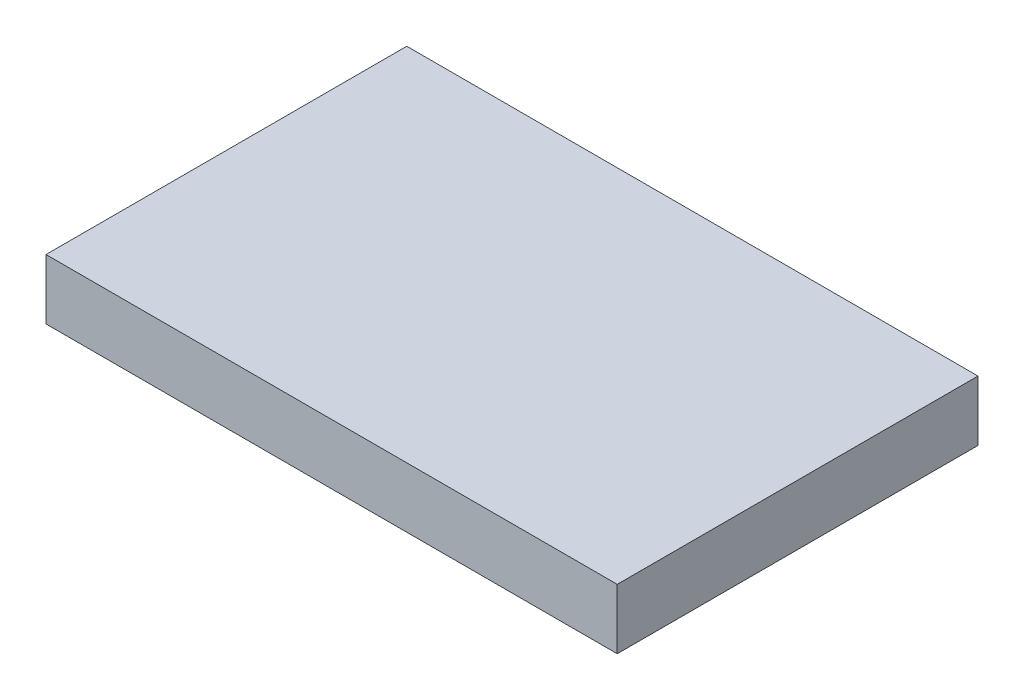
ISO-10303-21;
HEADER;
FILE_DESCRIPTION(('STEP AP214'),'2;1');
FILE_NAME('part.step','',(''),(''),'','','');
FILE_SCHEMA(('AUTOMOTIVE_DESIGN { 1 0 10303 214 1 1 1 1 }'));
ENDSEC;
DATA;
#1=APPLICATION_CONTEXT('core data for automotive mechanical design processes');
#2=APPLICATION_PROTOCOL_DEFINITION('international standard','automotive_design',2000,#1);
#3=PRODUCT_CONTEXT('',#1,'mechanical');
#4=PRODUCT('Part','Part','',(#3));
#5=PRODUCT_RELATED_PRODUCT_CATEGORY('part','',(#4));
#6=PRODUCT_DEFINITION_FORMATION('','',#4);
#7=PRODUCT_DEFINITION_CONTEXT('part definition',#1,'design');
#8=PRODUCT_DEFINITION('design','',#6,#7);
#9=PRODUCT_DEFINITION_SHAPE('','',#8);
#10=(LENGTH_UNIT() NAMED_UNIT(*) SI_UNIT(.MILLI.,.METRE.));
#11=(NAMED_UNIT(*) PLANE_ANGLE_UNIT() SI_UNIT($,.RADIAN.));
#12=(NAMED_UNIT(*) SI_UNIT($,.STERADIAN.) SOLID_ANGLE_UNIT());
#13=UNCERTAINTY_MEASURE_WITH_UNIT(LENGTH_MEASURE(1.E-05),#10,'distance_accuracy_value','');
#14=(GEOMETRIC_REPRESENTATION_CONTEXT(3) GLOBAL_UNCERTAINTY_ASSIGNED_CONTEXT((#13)) GLOBAL_UNIT_ASSIGNED_CONTEXT((#10,
#11,#12)) REPRESENTATION_CONTEXT('',''));
#15=CARTESIAN_POINT('',(0.,0.,0.));
#16=DIRECTION('',(0.,0.,1.));
#17=DIRECTION('',(1.,0.,0.));
#18=AXIS2_PLACEMENT_3D('',#15,#16,#17);
#19=CARTESIAN_POINT('',(0.,4.,0.));
#20=DIRECTION('',(1.,0.,0.));
#21=DIRECTION('',(0.,0.,-1.));
#22=AXIS2_PLACEMENT_3D('',#19,#20,#21);
#23=PLANE('',#22);
#24=DIRECTION('',(0.,0.,1.));
#25=VECTOR('',#24,1.);
#26=CARTESIAN_POINT('',(0.,0.,0.));
#27=LINE('',#26,#25);
#28=CARTESIAN_POINT('',(0.,0.,0.));
#29=VERTEX_POINT('',#28);
#30=CARTESIAN_POINT('',(0.,0.,24.));
#31=VERTEX_POINT('',#30);
#32=EDGE_CURVE('E96',#29,#31,#27,.T.);
#33=ORIENTED_EDGE('',*,*,#32,.T.);
#34=DIRECTION('',(0.,-1.,0.));
#35=VECTOR('',#34,1.);
#36=CARTESIAN_POINT('',(0.,4.,24.));
#37=LINE('',#36,#35);
#38=CARTESIAN_POINT('',(0.,4.,24.));
#39=VERTEX_POINT('',#38);
#40=EDGE_CURVE('E11',#39,#31,#37,.T.);
#41=ORIENTED_EDGE('',*,*,#40,.F.);
#42=DIRECTION('',(0.,0.,1.));
#43=VECTOR('',#42,1.);
#44=CARTESIAN_POINT('',(0.,4.,0.));
#45=LINE('',#44,#43);
#46=CARTESIAN_POINT('',(0.,4.,0.));
#47=VERTEX_POINT('',#46);
#48=EDGE_CURVE('E84',#47,#39,#45,.T.);
#49=ORIENTED_EDGE('',*,*,#48,.F.);
#50=DIRECTION('',(0.,-1.,0.));
#51=VECTOR('',#50,1.);
#52=CARTESIAN_POINT('',(0.,4.,0.));
#53=LINE('',#52,#51);
#54=EDGE_CURVE('E92',#47,#29,#53,.T.);
#55=ORIENTED_EDGE('',*,*,#54,.T.);
#56=EDGE_LOOP('',(#33,#41,#49,#55));
#57=FACE_BOUND('',#56,.T.);
#58=ADVANCED_FACE('F33',(#57),#23,.F.);
#59=CARTESIAN_POINT('',(0.,4.,24.));
#60=DIRECTION('',(0.,0.,-1.));
#61=DIRECTION('',(-1.,0.,0.));
#62=AXIS2_PLACEMENT_3D('',#59,#60,#61);
#63=PLANE('',#62);
#64=DIRECTION('',(1.,0.,0.));
#65=VECTOR('',#64,1.);
#66=CARTESIAN_POINT('',(0.,0.,24.));
#67=LINE('',#66,#65);
#68=CARTESIAN_POINT('',(38.,0.,24.));
#69=VERTEX_POINT('',#68);
#70=EDGE_CURVE('E88',#31,#69,#67,.T.);
#71=ORIENTED_EDGE('',*,*,#70,.T.);
#72=DIRECTION('',(0.,-1.,0.));
#73=VECTOR('',#72,1.);
#74=CARTESIAN_POINT('',(38.,4.,24.));
#75=LINE('',#74,#73);
#76=CARTESIAN_POINT('',(38.,4.,24.));
#77=VERTEX_POINT('',#76);
#78=EDGE_CURVE('E41',#77,#69,#75,.T.);
#79=ORIENTED_EDGE('',*,*,#78,.F.);
#80=DIRECTION('',(1.,0.,0.));
#81=VECTOR('',#80,1.);
#82=CARTESIAN_POINT('',(0.,4.,24.));
#83=LINE('',#82,#81);
#84=EDGE_CURVE('E79',#39,#77,#83,.T.);
#85=ORIENTED_EDGE('',*,*,#84,.F.);
#86=ORIENTED_EDGE('',*,*,#40,.T.);
#87=EDGE_LOOP('',(#71,#79,#85,#86));
#88=FACE_BOUND('',#87,.T.);
#89=ADVANCED_FACE('F87',(#88),#63,.F.);
#90=CARTESIAN_POINT('',(38.,4.,0.));
#91=DIRECTION('',(-1.,0.,0.));
#92=DIRECTION('',(0.,0.,1.));
#93=AXIS2_PLACEMENT_3D('',#90,#91,#92);
#94=PLANE('',#93);
#95=DIRECTION('',(0.,0.,-1.));
#96=VECTOR('',#95,1.);
#97=CARTESIAN_POINT('',(38.,0.,0.));
#98=LINE('',#97,#96);
#99=CARTESIAN_POINT('',(38.,0.,0.));
#100=VERTEX_POINT('',#99);
#101=EDGE_CURVE('E66',#69,#100,#98,.T.);
#102=ORIENTED_EDGE('',*,*,#101,.T.);
#103=DIRECTION('',(0.,-1.,0.));
#104=VECTOR('',#103,1.);
#105=CARTESIAN_POINT('',(38.,4.,0.));
#106=LINE('',#105,#104);
#107=CARTESIAN_POINT('',(38.,4.,0.));
#108=VERTEX_POINT('',#107);
#109=EDGE_CURVE('E89',#108,#100,#106,.T.);
#110=ORIENTED_EDGE('',*,*,#109,.F.);
#111=DIRECTION('',(0.,0.,-1.));
#112=VECTOR('',#111,1.);
#113=CARTESIAN_POINT('',(38.,4.,0.));
#114=LINE('',#113,#112);
#115=EDGE_CURVE('E82',#77,#108,#114,.T.);
#116=ORIENTED_EDGE('',*,*,#115,.F.);
#117=ORIENTED_EDGE('',*,*,#78,.T.);
#118=EDGE_LOOP('',(#102,#110,#116,#117));
#119=FACE_BOUND('',#118,.T.);
#120=ADVANCED_FACE('F90',(#119),#94,.F.);
#121=CARTESIAN_POINT('',(0.,4.,0.));
#122=DIRECTION('',(0.,0.,1.));
#123=DIRECTION('',(1.,0.,0.));
#124=AXIS2_PLACEMENT_3D('',#121,#122,#123);
#125=PLANE('',#124);
#126=DIRECTION('',(-1.,0.,0.));
#127=VECTOR('',#126,1.);
#128=CARTESIAN_POINT('',(0.,0.,0.));
#129=LINE('',#128,#127);
#130=EDGE_CURVE('E72',#100,#29,#129,.T.);
#131=ORIENTED_EDGE('',*,*,#130,.T.);
#132=ORIENTED_EDGE('',*,*,#54,.F.);
#133=DIRECTION('',(-1.,0.,0.));
#134=VECTOR('',#133,1.);
#135=CARTESIAN_POINT('',(0.,4.,0.));
#136=LINE('',#135,#134);
#137=EDGE_CURVE('E49',#108,#47,#136,.T.);
#138=ORIENTED_EDGE('',*,*,#137,.F.);
#139=ORIENTED_EDGE('',*,*,#109,.T.);
#140=EDGE_LOOP('',(#131,#132,#138,#139));
#141=FACE_BOUND('',#140,.T.);
#142=ADVANCED_FACE('F103',(#141),#125,.F.);
#143=CARTESIAN_POINT('',(0.,4.,0.));
#144=DIRECTION('',(0.,1.,0.));
#145=DIRECTION('',(0.,0.,1.));
#146=AXIS2_PLACEMENT_3D('',#143,#144,#145);
#147=PLANE('',#146);
#148=ORIENTED_EDGE('',*,*,#48,.T.);
#149=ORIENTED_EDGE('',*,*,#84,.T.);
#150=ORIENTED_EDGE('',*,*,#115,.T.);
#151=ORIENTED_EDGE('',*,*,#137,.T.);
#152=EDGE_LOOP('',(#148,#149,#150,#151));
#153=FACE_BOUND('',#152,.T.);
#154=ADVANCED_FACE('F80',(#153),#147,.T.);
#155=CARTESIAN_POINT('',(0.,0.,0.));
#156=DIRECTION('',(0.,1.,0.));
#157=DIRECTION('',(0.,0.,1.));
#158=AXIS2_PLACEMENT_3D('',#155,#156,#157);
#159=PLANE('',#158);
#160=ORIENTED_EDGE('',*,*,#32,.F.);
#161=ORIENTED_EDGE('',*,*,#130,.F.);
#162=ORIENTED_EDGE('',*,*,#101,.F.);
#163=ORIENTED_EDGE('',*,*,#70,.F.);
#164=EDGE_LOOP('',(#160,#161,#162,#163));
#165=FACE_BOUND('',#164,.T.);
#166=ADVANCED_FACE('F106',(#165),#159,.F.);
#167=CLOSED_SHELL('',(#58,#89,#120,#142,#154,#166));
#168=MANIFOLD_SOLID_BREP('B2',#167);
#169=ADVANCED_BREP_SHAPE_REPRESENTATION('',(#18,#168),#14);
#170=SHAPE_DEFINITION_REPRESENTATION(#9,#169);
ENDSEC;
END-ISO-10303-21;
